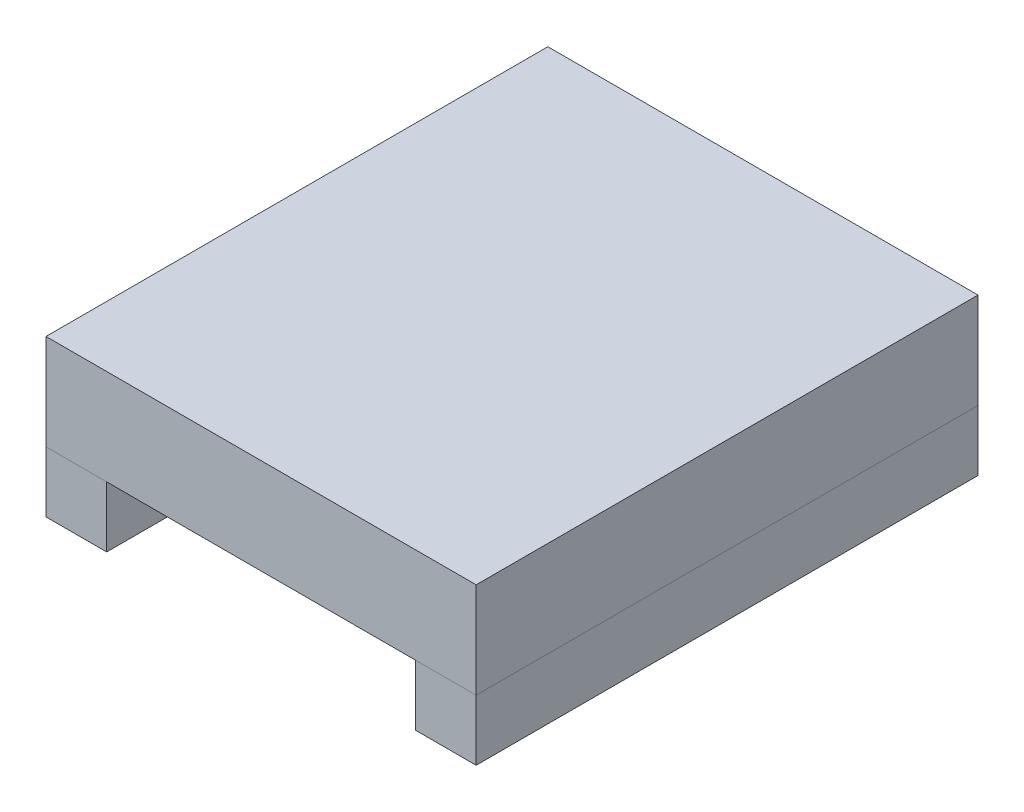
ISO-10303-21;
HEADER;
FILE_DESCRIPTION(('STEP AP214'),'2;1');
FILE_NAME('part.step','',(''),(''),'','','');
FILE_SCHEMA(('AUTOMOTIVE_DESIGN { 1 0 10303 214 1 1 1 1 }'));
ENDSEC;
DATA;
#1=APPLICATION_CONTEXT('core data for automotive mechanical design processes');
#2=APPLICATION_PROTOCOL_DEFINITION('international standard','automotive_design',2000,#1);
#3=PRODUCT_CONTEXT('',#1,'mechanical');
#4=PRODUCT('Part','Part','',(#3));
#5=PRODUCT_RELATED_PRODUCT_CATEGORY('part','',(#4));
#6=PRODUCT_DEFINITION_FORMATION('','',#4);
#7=PRODUCT_DEFINITION_CONTEXT('part definition',#1,'design');
#8=PRODUCT_DEFINITION('design','',#6,#7);
#9=PRODUCT_DEFINITION_SHAPE('','',#8);
#10=(LENGTH_UNIT() NAMED_UNIT(*) SI_UNIT(.MILLI.,.METRE.));
#11=(NAMED_UNIT(*) PLANE_ANGLE_UNIT() SI_UNIT($,.RADIAN.));
#12=(NAMED_UNIT(*) SI_UNIT($,.STERADIAN.) SOLID_ANGLE_UNIT());
#13=UNCERTAINTY_MEASURE_WITH_UNIT(LENGTH_MEASURE(1.E-05),#10,'distance_accuracy_value','');
#14=(GEOMETRIC_REPRESENTATION_CONTEXT(3) GLOBAL_UNCERTAINTY_ASSIGNED_CONTEXT((#13)) GLOBAL_UNIT_ASSIGNED_CONTEXT((#10,
#11,#12)) REPRESENTATION_CONTEXT('',''));
#15=CARTESIAN_POINT('',(0.,0.,0.));
#16=DIRECTION('',(0.,0.,1.));
#17=DIRECTION('',(1.,0.,0.));
#18=AXIS2_PLACEMENT_3D('',#15,#16,#17);
#19=CARTESIAN_POINT('',(9.00000000000001,-2.54,10.5));
#20=DIRECTION('',(0.,0.,-1.));
#21=DIRECTION('',(-1.,0.,0.));
#22=AXIS2_PLACEMENT_3D('',#19,#20,#21);
#23=PLANE('',#22);
#24=DIRECTION('',(-1.,0.,0.));
#25=VECTOR('',#24,1.);
#26=CARTESIAN_POINT('',(9.00000000000001,0.,10.5));
#27=LINE('',#26,#25);
#28=CARTESIAN_POINT('',(9.00000000000001,0.,10.5));
#29=VERTEX_POINT('',#28);
#30=CARTESIAN_POINT('',(6.46000000000001,0.,10.5));
#31=VERTEX_POINT('',#30);
#32=EDGE_CURVE('E109',#29,#31,#27,.T.);
#33=ORIENTED_EDGE('',*,*,#32,.T.);
#34=DIRECTION('',(0.,1.,0.));
#35=VECTOR('',#34,1.);
#36=CARTESIAN_POINT('',(6.46000000000001,-2.54,10.5));
#37=LINE('',#36,#35);
#38=CARTESIAN_POINT('',(6.46000000000001,-2.54,10.5));
#39=VERTEX_POINT('',#38);
#40=EDGE_CURVE('E12',#39,#31,#37,.T.);
#41=ORIENTED_EDGE('',*,*,#40,.F.);
#42=DIRECTION('',(-1.,0.,0.));
#43=VECTOR('',#42,1.);
#44=CARTESIAN_POINT('',(9.00000000000001,-2.54,10.5));
#45=LINE('',#44,#43);
#46=CARTESIAN_POINT('',(9.00000000000001,-2.54,10.5));
#47=VERTEX_POINT('',#46);
#48=EDGE_CURVE('E97',#47,#39,#45,.T.);
#49=ORIENTED_EDGE('',*,*,#48,.F.);
#50=DIRECTION('',(0.,1.,0.));
#51=VECTOR('',#50,1.);
#52=CARTESIAN_POINT('',(9.00000000000001,-2.54,10.5));
#53=LINE('',#52,#51);
#54=EDGE_CURVE('E105',#47,#29,#53,.T.);
#55=ORIENTED_EDGE('',*,*,#54,.T.);
#56=EDGE_LOOP('',(#33,#41,#49,#55));
#57=FACE_BOUND('',#56,.T.);
#58=ADVANCED_FACE('F46',(#57),#23,.F.);
#59=CARTESIAN_POINT('',(6.46000000000001,-2.54,10.5));
#60=DIRECTION('',(1.,0.,0.));
#61=DIRECTION('',(0.,0.,-1.));
#62=AXIS2_PLACEMENT_3D('',#59,#60,#61);
#63=PLANE('',#62);
#64=DIRECTION('',(0.,0.,-1.));
#65=VECTOR('',#64,1.);
#66=CARTESIAN_POINT('',(6.46000000000001,0.,10.5));
#67=LINE('',#66,#65);
#68=CARTESIAN_POINT('',(6.46,0.,-10.5));
#69=VERTEX_POINT('',#68);
#70=EDGE_CURVE('E101',#31,#69,#67,.T.);
#71=ORIENTED_EDGE('',*,*,#70,.T.);
#72=DIRECTION('',(0.,1.,0.));
#73=VECTOR('',#72,1.);
#74=CARTESIAN_POINT('',(6.46,-2.54,-10.5));
#75=LINE('',#74,#73);
#76=CARTESIAN_POINT('',(6.46,-2.54,-10.5));
#77=VERTEX_POINT('',#76);
#78=EDGE_CURVE('E54',#77,#69,#75,.T.);
#79=ORIENTED_EDGE('',*,*,#78,.F.);
#80=DIRECTION('',(0.,0.,-1.));
#81=VECTOR('',#80,1.);
#82=CARTESIAN_POINT('',(6.46000000000001,-2.54,10.5));
#83=LINE('',#82,#81);
#84=EDGE_CURVE('E92',#39,#77,#83,.T.);
#85=ORIENTED_EDGE('',*,*,#84,.F.);
#86=ORIENTED_EDGE('',*,*,#40,.T.);
#87=EDGE_LOOP('',(#71,#79,#85,#86));
#88=FACE_BOUND('',#87,.T.);
#89=ADVANCED_FACE('F100',(#88),#63,.F.);
#90=CARTESIAN_POINT('',(9.00000000000001,-2.54,-10.5));
#91=DIRECTION('',(0.,0.,1.));
#92=DIRECTION('',(1.,0.,0.));
#93=AXIS2_PLACEMENT_3D('',#90,#91,#92);
#94=PLANE('',#93);
#95=DIRECTION('',(1.,0.,0.));
#96=VECTOR('',#95,1.);
#97=CARTESIAN_POINT('',(9.00000000000001,0.,-10.5));
#98=LINE('',#97,#96);
#99=CARTESIAN_POINT('',(9.00000000000001,0.,-10.5));
#100=VERTEX_POINT('',#99);
#101=EDGE_CURVE('E79',#69,#100,#98,.T.);
#102=ORIENTED_EDGE('',*,*,#101,.T.);
#103=DIRECTION('',(0.,1.,0.));
#104=VECTOR('',#103,1.);
#105=CARTESIAN_POINT('',(9.00000000000001,-2.54,-10.5));
#106=LINE('',#105,#104);
#107=CARTESIAN_POINT('',(9.00000000000001,-2.54,-10.5));
#108=VERTEX_POINT('',#107);
#109=EDGE_CURVE('E102',#108,#100,#106,.T.);
#110=ORIENTED_EDGE('',*,*,#109,.F.);
#111=DIRECTION('',(1.,0.,0.));
#112=VECTOR('',#111,1.);
#113=CARTESIAN_POINT('',(9.00000000000001,-2.54,-10.5));
#114=LINE('',#113,#112);
#115=EDGE_CURVE('E95',#77,#108,#114,.T.);
#116=ORIENTED_EDGE('',*,*,#115,.F.);
#117=ORIENTED_EDGE('',*,*,#78,.T.);
#118=EDGE_LOOP('',(#102,#110,#116,#117));
#119=FACE_BOUND('',#118,.T.);
#120=ADVANCED_FACE('F103',(#119),#94,.F.);
#121=CARTESIAN_POINT('',(9.00000000000001,-2.54,10.5));
#122=DIRECTION('',(-1.,0.,0.));
#123=DIRECTION('',(0.,0.,1.));
#124=AXIS2_PLACEMENT_3D('',#121,#122,#123);
#125=PLANE('',#124);
#126=DIRECTION('',(0.,0.,1.));
#127=VECTOR('',#126,1.);
#128=CARTESIAN_POINT('',(9.00000000000001,0.,10.5));
#129=LINE('',#128,#127);
#130=EDGE_CURVE('E85',#100,#29,#129,.T.);
#131=ORIENTED_EDGE('',*,*,#130,.T.);
#132=ORIENTED_EDGE('',*,*,#54,.F.);
#133=DIRECTION('',(0.,0.,1.));
#134=VECTOR('',#133,1.);
#135=CARTESIAN_POINT('',(9.00000000000001,-2.54,10.5));
#136=LINE('',#135,#134);
#137=EDGE_CURVE('E62',#108,#47,#136,.T.);
#138=ORIENTED_EDGE('',*,*,#137,.F.);
#139=ORIENTED_EDGE('',*,*,#109,.T.);
#140=EDGE_LOOP('',(#131,#132,#138,#139));
#141=FACE_BOUND('',#140,.T.);
#142=ADVANCED_FACE('F116',(#141),#125,.F.);
#143=CARTESIAN_POINT('',(0.,-2.54,0.));
#144=DIRECTION('',(0.,-1.,0.));
#145=DIRECTION('',(0.,0.,-1.));
#146=AXIS2_PLACEMENT_3D('',#143,#144,#145);
#147=PLANE('',#146);
#148=ORIENTED_EDGE('',*,*,#48,.T.);
#149=ORIENTED_EDGE('',*,*,#84,.T.);
#150=ORIENTED_EDGE('',*,*,#115,.T.);
#151=ORIENTED_EDGE('',*,*,#137,.T.);
#152=EDGE_LOOP('',(#148,#149,#150,#151));
#153=FACE_BOUND('',#152,.T.);
#154=ADVANCED_FACE('F93',(#153),#147,.T.);
#155=CARTESIAN_POINT('',(0.,0.,0.));
#156=DIRECTION('',(0.,-1.,0.));
#157=DIRECTION('',(0.,0.,-1.));
#158=AXIS2_PLACEMENT_3D('',#155,#156,#157);
#159=PLANE('',#158);
#160=ORIENTED_EDGE('',*,*,#32,.F.);
#161=ORIENTED_EDGE('',*,*,#130,.F.);
#162=ORIENTED_EDGE('',*,*,#101,.F.);
#163=ORIENTED_EDGE('',*,*,#70,.F.);
#164=EDGE_LOOP('',(#160,#161,#162,#163));
#165=FACE_BOUND('',#164,.T.);
#166=ADVANCED_FACE('F119',(#165),#159,.F.);
#167=CLOSED_SHELL('',(#58,#89,#120,#142,#154,#166));
#168=MANIFOLD_SOLID_BREP('B2',#167);
#169=CARTESIAN_POINT('',(-8.99999999999999,-2.54,10.5));
#170=DIRECTION('',(1.,0.,0.));
#171=DIRECTION('',(0.,0.,-1.));
#172=AXIS2_PLACEMENT_3D('',#169,#170,#171);
#173=PLANE('',#172);
#174=DIRECTION('',(0.,0.,-1.));
#175=VECTOR('',#174,1.);
#176=CARTESIAN_POINT('',(-8.99999999999999,0.,10.5));
#177=LINE('',#176,#175);
#178=CARTESIAN_POINT('',(-8.99999999999999,0.,10.5));
#179=VERTEX_POINT('',#178);
#180=CARTESIAN_POINT('',(-8.99999999999999,0.,-10.5));
#181=VERTEX_POINT('',#180);
#182=EDGE_CURVE('E242',#179,#181,#177,.T.);
#183=ORIENTED_EDGE('',*,*,#182,.T.);
#184=DIRECTION('',(0.,1.,0.));
#185=VECTOR('',#184,1.);
#186=CARTESIAN_POINT('',(-8.99999999999999,-2.54,-10.5));
#187=LINE('',#186,#185);
#188=CARTESIAN_POINT('',(-8.99999999999999,-2.54,-10.5));
#189=VERTEX_POINT('',#188);
#190=EDGE_CURVE('E44',#189,#181,#187,.T.);
#191=ORIENTED_EDGE('',*,*,#190,.F.);
#192=DIRECTION('',(0.,0.,-1.));
#193=VECTOR('',#192,1.);
#194=CARTESIAN_POINT('',(-8.99999999999999,-2.54,10.5));
#195=LINE('',#194,#193);
#196=CARTESIAN_POINT('',(-8.99999999999999,-2.54,10.5));
#197=VERTEX_POINT('',#196);
#198=EDGE_CURVE('E230',#197,#189,#195,.T.);
#199=ORIENTED_EDGE('',*,*,#198,.F.);
#200=DIRECTION('',(0.,1.,0.));
#201=VECTOR('',#200,1.);
#202=CARTESIAN_POINT('',(-8.99999999999999,-2.54,10.5));
#203=LINE('',#202,#201);
#204=EDGE_CURVE('E238',#197,#179,#203,.T.);
#205=ORIENTED_EDGE('',*,*,#204,.T.);
#206=EDGE_LOOP('',(#183,#191,#199,#205));
#207=FACE_BOUND('',#206,.T.);
#208=ADVANCED_FACE('F179',(#207),#173,.F.);
#209=CARTESIAN_POINT('',(-8.99999999999999,-2.54,-10.5));
#210=DIRECTION('',(0.,0.,1.));
#211=DIRECTION('',(1.,0.,0.));
#212=AXIS2_PLACEMENT_3D('',#209,#210,#211);
#213=PLANE('',#212);
#214=DIRECTION('',(1.,0.,0.));
#215=VECTOR('',#214,1.);
#216=CARTESIAN_POINT('',(-8.99999999999999,0.,-10.5));
#217=LINE('',#216,#215);
#218=CARTESIAN_POINT('',(-6.45999999999999,0.,-10.5));
#219=VERTEX_POINT('',#218);
#220=EDGE_CURVE('E234',#181,#219,#217,.T.);
#221=ORIENTED_EDGE('',*,*,#220,.T.);
#222=DIRECTION('',(0.,1.,0.));
#223=VECTOR('',#222,1.);
#224=CARTESIAN_POINT('',(-6.45999999999999,-2.54,-10.5));
#225=LINE('',#224,#223);
#226=CARTESIAN_POINT('',(-6.45999999999999,-2.54,-10.5));
#227=VERTEX_POINT('',#226);
#228=EDGE_CURVE('E187',#227,#219,#225,.T.);
#229=ORIENTED_EDGE('',*,*,#228,.F.);
#230=DIRECTION('',(1.,0.,0.));
#231=VECTOR('',#230,1.);
#232=CARTESIAN_POINT('',(-8.99999999999999,-2.54,-10.5));
#233=LINE('',#232,#231);
#234=EDGE_CURVE('E225',#189,#227,#233,.T.);
#235=ORIENTED_EDGE('',*,*,#234,.F.);
#236=ORIENTED_EDGE('',*,*,#190,.T.);
#237=EDGE_LOOP('',(#221,#229,#235,#236));
#238=FACE_BOUND('',#237,.T.);
#239=ADVANCED_FACE('F233',(#238),#213,.F.);
#240=CARTESIAN_POINT('',(-6.45999999999999,-2.54,10.5));
#241=DIRECTION('',(-1.,0.,0.));
#242=DIRECTION('',(0.,0.,1.));
#243=AXIS2_PLACEMENT_3D('',#240,#241,#242);
#244=PLANE('',#243);
#245=DIRECTION('',(0.,0.,1.));
#246=VECTOR('',#245,1.);
#247=CARTESIAN_POINT('',(-6.45999999999999,0.,10.5));
#248=LINE('',#247,#246);
#249=CARTESIAN_POINT('',(-6.45999999999999,0.,10.5));
#250=VERTEX_POINT('',#249);
#251=EDGE_CURVE('E212',#219,#250,#248,.T.);
#252=ORIENTED_EDGE('',*,*,#251,.T.);
#253=DIRECTION('',(0.,1.,0.));
#254=VECTOR('',#253,1.);
#255=CARTESIAN_POINT('',(-6.45999999999999,-2.54,10.5));
#256=LINE('',#255,#254);
#257=CARTESIAN_POINT('',(-6.45999999999999,-2.54,10.5));
#258=VERTEX_POINT('',#257);
#259=EDGE_CURVE('E235',#258,#250,#256,.T.);
#260=ORIENTED_EDGE('',*,*,#259,.F.);
#261=DIRECTION('',(0.,0.,1.));
#262=VECTOR('',#261,1.);
#263=CARTESIAN_POINT('',(-6.45999999999999,-2.54,10.5));
#264=LINE('',#263,#262);
#265=EDGE_CURVE('E228',#227,#258,#264,.T.);
#266=ORIENTED_EDGE('',*,*,#265,.F.);
#267=ORIENTED_EDGE('',*,*,#228,.T.);
#268=EDGE_LOOP('',(#252,#260,#266,#267));
#269=FACE_BOUND('',#268,.T.);
#270=ADVANCED_FACE('F236',(#269),#244,.F.);
#271=CARTESIAN_POINT('',(-8.99999999999999,-2.54,10.5));
#272=DIRECTION('',(0.,0.,-1.));
#273=DIRECTION('',(-1.,0.,0.));
#274=AXIS2_PLACEMENT_3D('',#271,#272,#273);
#275=PLANE('',#274);
#276=DIRECTION('',(-1.,0.,0.));
#277=VECTOR('',#276,1.);
#278=CARTESIAN_POINT('',(-8.99999999999999,0.,10.5));
#279=LINE('',#278,#277);
#280=EDGE_CURVE('E218',#250,#179,#279,.T.);
#281=ORIENTED_EDGE('',*,*,#280,.T.);
#282=ORIENTED_EDGE('',*,*,#204,.F.);
#283=DIRECTION('',(-1.,0.,0.));
#284=VECTOR('',#283,1.);
#285=CARTESIAN_POINT('',(-8.99999999999999,-2.54,10.5));
#286=LINE('',#285,#284);
#287=EDGE_CURVE('E195',#258,#197,#286,.T.);
#288=ORIENTED_EDGE('',*,*,#287,.F.);
#289=ORIENTED_EDGE('',*,*,#259,.T.);
#290=EDGE_LOOP('',(#281,#282,#288,#289));
#291=FACE_BOUND('',#290,.T.);
#292=ADVANCED_FACE('F249',(#291),#275,.F.);
#293=CARTESIAN_POINT('',(0.,-2.54,0.));
#294=DIRECTION('',(0.,-1.,0.));
#295=DIRECTION('',(0.,0.,-1.));
#296=AXIS2_PLACEMENT_3D('',#293,#294,#295);
#297=PLANE('',#296);
#298=ORIENTED_EDGE('',*,*,#198,.T.);
#299=ORIENTED_EDGE('',*,*,#234,.T.);
#300=ORIENTED_EDGE('',*,*,#265,.T.);
#301=ORIENTED_EDGE('',*,*,#287,.T.);
#302=EDGE_LOOP('',(#298,#299,#300,#301));
#303=FACE_BOUND('',#302,.T.);
#304=ADVANCED_FACE('F226',(#303),#297,.T.);
#305=CARTESIAN_POINT('',(0.,0.,0.));
#306=DIRECTION('',(0.,-1.,0.));
#307=DIRECTION('',(0.,0.,-1.));
#308=AXIS2_PLACEMENT_3D('',#305,#306,#307);
#309=PLANE('',#308);
#310=ORIENTED_EDGE('',*,*,#182,.F.);
#311=ORIENTED_EDGE('',*,*,#280,.F.);
#312=ORIENTED_EDGE('',*,*,#251,.F.);
#313=ORIENTED_EDGE('',*,*,#220,.F.);
#314=EDGE_LOOP('',(#310,#311,#312,#313));
#315=FACE_BOUND('',#314,.T.);
#316=ADVANCED_FACE('F252',(#315),#309,.F.);
#317=CLOSED_SHELL('',(#208,#239,#270,#292,#304,#316));
#318=MANIFOLD_SOLID_BREP('B6',#317);
#319=CARTESIAN_POINT('',(9.00000000000001,4.,10.5));
#320=DIRECTION('',(-1.,0.,0.));
#321=DIRECTION('',(0.,0.,1.));
#322=AXIS2_PLACEMENT_3D('',#319,#320,#321);
#323=PLANE('',#322);
#324=DIRECTION('',(0.,0.,-1.));
#325=VECTOR('',#324,1.);
#326=CARTESIAN_POINT('',(9.00000000000001,0.,10.5));
#327=LINE('',#326,#325);
#328=CARTESIAN_POINT('',(9.00000000000001,0.,10.5));
#329=VERTEX_POINT('',#328);
#330=CARTESIAN_POINT('',(9.00000000000001,0.,-10.5));
#331=VERTEX_POINT('',#330);
#332=EDGE_CURVE('E366',#329,#331,#327,.T.);
#333=ORIENTED_EDGE('',*,*,#332,.T.);
#334=DIRECTION('',(0.,-1.,0.));
#335=VECTOR('',#334,1.);
#336=CARTESIAN_POINT('',(9.00000000000001,4.,-10.5));
#337=LINE('',#336,#335);
#338=CARTESIAN_POINT('',(9.00000000000001,4.,-10.5));
#339=VERTEX_POINT('',#338);
#340=EDGE_CURVE('E177',#339,#331,#337,.T.);
#341=ORIENTED_EDGE('',*,*,#340,.F.);
#342=DIRECTION('',(0.,0.,-1.));
#343=VECTOR('',#342,1.);
#344=CARTESIAN_POINT('',(9.00000000000001,4.,10.5));
#345=LINE('',#344,#343);
#346=CARTESIAN_POINT('',(9.00000000000001,4.,10.5));
#347=VERTEX_POINT('',#346);
#348=EDGE_CURVE('E354',#347,#339,#345,.T.);
#349=ORIENTED_EDGE('',*,*,#348,.F.);
#350=DIRECTION('',(0.,-1.,0.));
#351=VECTOR('',#350,1.);
#352=CARTESIAN_POINT('',(9.00000000000001,4.,10.5));
#353=LINE('',#352,#351);
#354=EDGE_CURVE('E362',#347,#329,#353,.T.);
#355=ORIENTED_EDGE('',*,*,#354,.T.);
#356=EDGE_LOOP('',(#333,#341,#349,#355));
#357=FACE_BOUND('',#356,.T.);
#358=ADVANCED_FACE('F303',(#357),#323,.F.);
#359=CARTESIAN_POINT('',(-8.99999999999999,4.,-10.5));
#360=DIRECTION('',(0.,0.,1.));
#361=DIRECTION('',(1.,0.,0.));
#362=AXIS2_PLACEMENT_3D('',#359,#360,#361);
#363=PLANE('',#362);
#364=DIRECTION('',(-1.,0.,0.));
#365=VECTOR('',#364,1.);
#366=CARTESIAN_POINT('',(-8.99999999999999,0.,-10.5));
#367=LINE('',#366,#365);
#368=CARTESIAN_POINT('',(-8.99999999999999,0.,-10.5));
#369=VERTEX_POINT('',#368);
#370=EDGE_CURVE('E358',#331,#369,#367,.T.);
#371=ORIENTED_EDGE('',*,*,#370,.T.);
#372=DIRECTION('',(0.,-1.,0.));
#373=VECTOR('',#372,1.);
#374=CARTESIAN_POINT('',(-8.99999999999999,4.,-10.5));
#375=LINE('',#374,#373);
#376=CARTESIAN_POINT('',(-8.99999999999999,4.,-10.5));
#377=VERTEX_POINT('',#376);
#378=EDGE_CURVE('E311',#377,#369,#375,.T.);
#379=ORIENTED_EDGE('',*,*,#378,.F.);
#380=DIRECTION('',(-1.,0.,0.));
#381=VECTOR('',#380,1.);
#382=CARTESIAN_POINT('',(-8.99999999999999,4.,-10.5));
#383=LINE('',#382,#381);
#384=EDGE_CURVE('E349',#339,#377,#383,.T.);
#385=ORIENTED_EDGE('',*,*,#384,.F.);
#386=ORIENTED_EDGE('',*,*,#340,.T.);
#387=EDGE_LOOP('',(#371,#379,#385,#386));
#388=FACE_BOUND('',#387,.T.);
#389=ADVANCED_FACE('F357',(#388),#363,.F.);
#390=CARTESIAN_POINT('',(-8.99999999999999,4.,10.5));
#391=DIRECTION('',(1.,0.,0.));
#392=DIRECTION('',(0.,0.,-1.));
#393=AXIS2_PLACEMENT_3D('',#390,#391,#392);
#394=PLANE('',#393);
#395=DIRECTION('',(0.,0.,1.));
#396=VECTOR('',#395,1.);
#397=CARTESIAN_POINT('',(-8.99999999999999,0.,10.5));
#398=LINE('',#397,#396);
#399=CARTESIAN_POINT('',(-8.99999999999999,0.,10.5));
#400=VERTEX_POINT('',#399);
#401=EDGE_CURVE('E336',#369,#400,#398,.T.);
#402=ORIENTED_EDGE('',*,*,#401,.T.);
#403=DIRECTION('',(0.,-1.,0.));
#404=VECTOR('',#403,1.);
#405=CARTESIAN_POINT('',(-8.99999999999999,4.,10.5));
#406=LINE('',#405,#404);
#407=CARTESIAN_POINT('',(-8.99999999999999,4.,10.5));
#408=VERTEX_POINT('',#407);
#409=EDGE_CURVE('E359',#408,#400,#406,.T.);
#410=ORIENTED_EDGE('',*,*,#409,.F.);
#411=DIRECTION('',(0.,0.,1.));
#412=VECTOR('',#411,1.);
#413=CARTESIAN_POINT('',(-8.99999999999999,4.,10.5));
#414=LINE('',#413,#412);
#415=EDGE_CURVE('E352',#377,#408,#414,.T.);
#416=ORIENTED_EDGE('',*,*,#415,.F.);
#417=ORIENTED_EDGE('',*,*,#378,.T.);
#418=EDGE_LOOP('',(#402,#410,#416,#417));
#419=FACE_BOUND('',#418,.T.);
#420=ADVANCED_FACE('F360',(#419),#394,.F.);
#421=CARTESIAN_POINT('',(-8.99999999999999,4.,10.5));
#422=DIRECTION('',(0.,0.,-1.));
#423=DIRECTION('',(-1.,0.,0.));
#424=AXIS2_PLACEMENT_3D('',#421,#422,#423);
#425=PLANE('',#424);
#426=DIRECTION('',(1.,0.,0.));
#427=VECTOR('',#426,1.);
#428=CARTESIAN_POINT('',(-8.99999999999999,0.,10.5));
#429=LINE('',#428,#427);
#430=EDGE_CURVE('E342',#400,#329,#429,.T.);
#431=ORIENTED_EDGE('',*,*,#430,.T.);
#432=ORIENTED_EDGE('',*,*,#354,.F.);
#433=DIRECTION('',(1.,0.,0.));
#434=VECTOR('',#433,1.);
#435=CARTESIAN_POINT('',(-8.99999999999999,4.,10.5));
#436=LINE('',#435,#434);
#437=EDGE_CURVE('E319',#408,#347,#436,.T.);
#438=ORIENTED_EDGE('',*,*,#437,.F.);
#439=ORIENTED_EDGE('',*,*,#409,.T.);
#440=EDGE_LOOP('',(#431,#432,#438,#439));
#441=FACE_BOUND('',#440,.T.);
#442=ADVANCED_FACE('F373',(#441),#425,.F.);
#443=CARTESIAN_POINT('',(0.,4.,0.));
#444=DIRECTION('',(0.,-1.,0.));
#445=DIRECTION('',(0.,0.,-1.));
#446=AXIS2_PLACEMENT_3D('',#443,#444,#445);
#447=PLANE('',#446);
#448=ORIENTED_EDGE('',*,*,#348,.T.);
#449=ORIENTED_EDGE('',*,*,#384,.T.);
#450=ORIENTED_EDGE('',*,*,#415,.T.);
#451=ORIENTED_EDGE('',*,*,#437,.T.);
#452=EDGE_LOOP('',(#448,#449,#450,#451));
#453=FACE_BOUND('',#452,.T.);
#454=ADVANCED_FACE('F350',(#453),#447,.F.);
#455=CARTESIAN_POINT('',(0.,0.,0.));
#456=DIRECTION('',(0.,-1.,0.));
#457=DIRECTION('',(0.,0.,-1.));
#458=AXIS2_PLACEMENT_3D('',#455,#456,#457);
#459=PLANE('',#458);
#460=ORIENTED_EDGE('',*,*,#332,.F.);
#461=ORIENTED_EDGE('',*,*,#430,.F.);
#462=ORIENTED_EDGE('',*,*,#401,.F.);
#463=ORIENTED_EDGE('',*,*,#370,.F.);
#464=EDGE_LOOP('',(#460,#461,#462,#463));
#465=FACE_BOUND('',#464,.T.);
#466=ADVANCED_FACE('F376',(#465),#459,.T.);
#467=CLOSED_SHELL('',(#358,#389,#420,#442,#454,#466));
#468=MANIFOLD_SOLID_BREP('B38',#467);
#469=ADVANCED_BREP_SHAPE_REPRESENTATION('',(#18,#168,#318,#468),#14);
#470=SHAPE_DEFINITION_REPRESENTATION(#9,#469);
ENDSEC;
END-ISO-10303-21;
